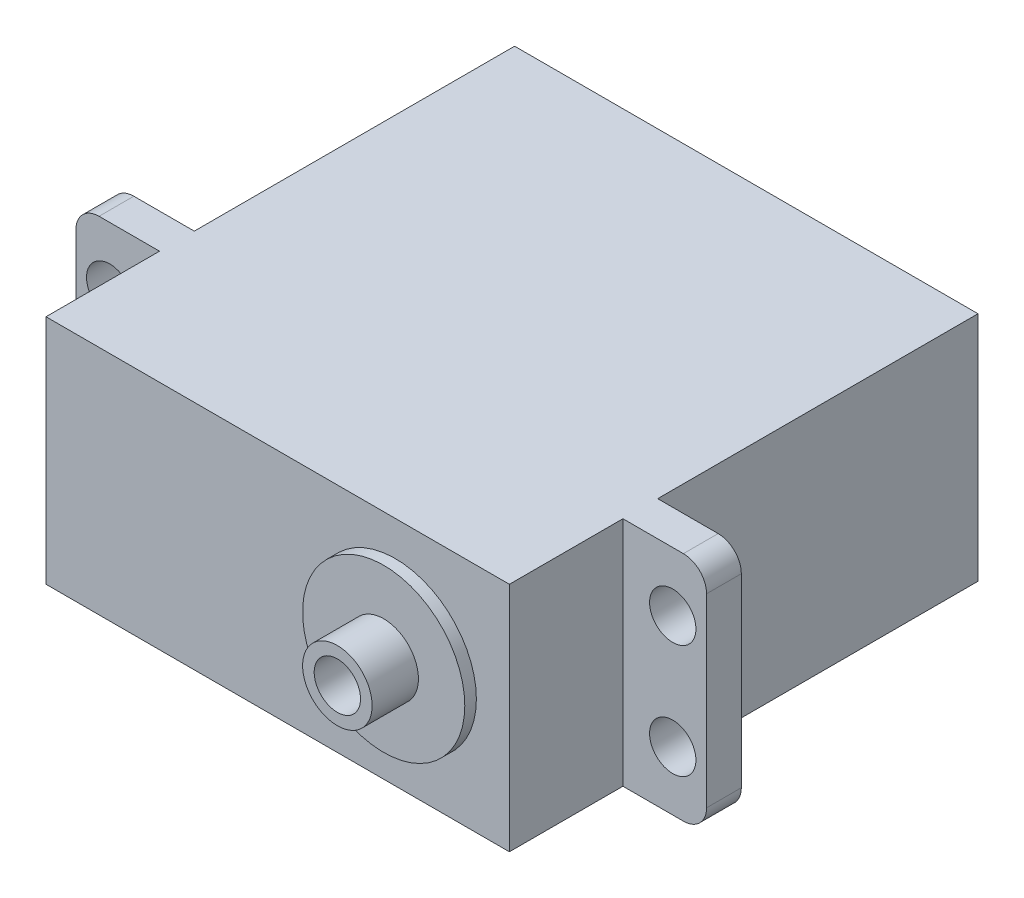
ISO-10303-21;
HEADER;
FILE_DESCRIPTION(('STEP AP214'),'2;1');
FILE_NAME('part.step','',(''),(''),'','','');
FILE_SCHEMA(('AUTOMOTIVE_DESIGN { 1 0 10303 214 1 1 1 1 }'));
ENDSEC;
DATA;
#1=APPLICATION_CONTEXT('core data for automotive mechanical design processes');
#2=APPLICATION_PROTOCOL_DEFINITION('international standard','automotive_design',2000,#1);
#3=PRODUCT_CONTEXT('',#1,'mechanical');
#4=PRODUCT('Part','Part','',(#3));
#5=PRODUCT_RELATED_PRODUCT_CATEGORY('part','',(#4));
#6=PRODUCT_DEFINITION_FORMATION('','',#4);
#7=PRODUCT_DEFINITION_CONTEXT('part definition',#1,'design');
#8=PRODUCT_DEFINITION('design','',#6,#7);
#9=PRODUCT_DEFINITION_SHAPE('','',#8);
#10=(LENGTH_UNIT() NAMED_UNIT(*) SI_UNIT(.MILLI.,.METRE.));
#11=(NAMED_UNIT(*) PLANE_ANGLE_UNIT() SI_UNIT($,.RADIAN.));
#12=(NAMED_UNIT(*) SI_UNIT($,.STERADIAN.) SOLID_ANGLE_UNIT());
#13=UNCERTAINTY_MEASURE_WITH_UNIT(LENGTH_MEASURE(1.E-05),#10,'distance_accuracy_value','');
#14=(GEOMETRIC_REPRESENTATION_CONTEXT(3) GLOBAL_UNCERTAINTY_ASSIGNED_CONTEXT((#13)) GLOBAL_UNIT_ASSIGNED_CONTEXT((#10,
#11,#12)) REPRESENTATION_CONTEXT('',''));
#15=CARTESIAN_POINT('',(0.,0.,0.));
#16=DIRECTION('',(0.,0.,1.));
#17=DIRECTION('',(1.,0.,0.));
#18=AXIS2_PLACEMENT_3D('',#15,#16,#17);
#19=CARTESIAN_POINT('',(0.,0.,30.65));
#20=DIRECTION('',(0.,0.,1.));
#21=DIRECTION('',(1.,0.,0.));
#22=AXIS2_PLACEMENT_3D('',#19,#20,#21);
#23=PLANE('',#22);
#24=DIRECTION('',(0.,1.,0.));
#25=VECTOR('',#24,1.);
#26=CARTESIAN_POINT('',(-6.37221553686137,208.387921433187,30.65));
#27=LINE('',#26,#25);
#28=CARTESIAN_POINT('',(-6.37221553686137,210.387921433187,30.65));
#29=VERTEX_POINT('',#28);
#30=CARTESIAN_POINT('',(-6.37221553686137,226.387921433187,30.65));
#31=VERTEX_POINT('',#30);
#32=EDGE_CURVE('E200',#29,#31,#27,.T.);
#33=ORIENTED_EDGE('',*,*,#32,.T.);
#34=CARTESIAN_POINT('',(-8.37221553686137,226.387921433187,30.65));
#35=DIRECTION('',(0.,0.,1.));
#36=DIRECTION('',(1.,0.,0.));
#37=AXIS2_PLACEMENT_3D('',#34,#35,#36);
#38=CIRCLE('',#37,2.);
#39=CARTESIAN_POINT('',(-8.37221553686137,228.387921433187,30.65));
#40=VERTEX_POINT('',#39);
#41=EDGE_CURVE('E11',#31,#40,#38,.T.);
#42=ORIENTED_EDGE('',*,*,#41,.T.);
#43=DIRECTION('',(-1.,0.,0.));
#44=VECTOR('',#43,1.);
#45=CARTESIAN_POINT('',(-6.37221553686137,228.387921433187,30.65));
#46=LINE('',#45,#44);
#47=CARTESIAN_POINT('',(-13.5922155368614,228.387921433187,30.65));
#48=VERTEX_POINT('',#47);
#49=EDGE_CURVE('E203',#40,#48,#46,.T.);
#50=ORIENTED_EDGE('',*,*,#49,.T.);
#51=DIRECTION('',(0.,1.,0.));
#52=VECTOR('',#51,1.);
#53=CARTESIAN_POINT('',(-13.5922155368614,208.387921433187,30.65));
#54=LINE('',#53,#52);
#55=CARTESIAN_POINT('',(-13.5922155368614,208.387921433187,30.65));
#56=VERTEX_POINT('',#55);
#57=EDGE_CURVE('E163',#56,#48,#54,.T.);
#58=ORIENTED_EDGE('',*,*,#57,.F.);
#59=DIRECTION('',(1.,0.,0.));
#60=VECTOR('',#59,1.);
#61=CARTESIAN_POINT('',(-6.37221553686137,208.387921433187,30.65));
#62=LINE('',#61,#60);
#63=CARTESIAN_POINT('',(-8.37221553686137,208.387921433187,30.65));
#64=VERTEX_POINT('',#63);
#65=EDGE_CURVE('E208',#56,#64,#62,.T.);
#66=ORIENTED_EDGE('',*,*,#65,.T.);
#67=CARTESIAN_POINT('',(-8.37221553686137,210.387921433187,30.65));
#68=DIRECTION('',(0.,0.,1.));
#69=DIRECTION('',(1.,0.,0.));
#70=AXIS2_PLACEMENT_3D('',#67,#68,#69);
#71=CIRCLE('',#70,2.);
#72=EDGE_CURVE('E38',#64,#29,#71,.T.);
#73=ORIENTED_EDGE('',*,*,#72,.T.);
#74=EDGE_LOOP('',(#33,#42,#50,#58,#66,#73));
#75=FACE_BOUND('',#74,.T.);
#76=CARTESIAN_POINT('',(-9.29221553686137,223.287921433187,30.65));
#77=DIRECTION('',(0.,0.,1.));
#78=DIRECTION('',(1.,0.,0.));
#79=AXIS2_PLACEMENT_3D('',#76,#77,#78);
#80=CIRCLE('',#79,2.);
#81=CARTESIAN_POINT('',(-7.29221553686137,223.287921433187,30.65));
#82=VERTEX_POINT('',#81);
#83=EDGE_CURVE('E188',#82,#82,#80,.T.);
#84=ORIENTED_EDGE('',*,*,#83,.F.);
#85=EDGE_LOOP('',(#84));
#86=FACE_BOUND('',#85,.T.);
#87=CARTESIAN_POINT('',(-9.29221553686137,213.487921433187,30.65));
#88=DIRECTION('',(0.,0.,1.));
#89=DIRECTION('',(1.,0.,0.));
#90=AXIS2_PLACEMENT_3D('',#87,#88,#89);
#91=CIRCLE('',#90,2.);
#92=CARTESIAN_POINT('',(-7.29221553686137,213.487921433187,30.65));
#93=VERTEX_POINT('',#92);
#94=EDGE_CURVE('E194',#93,#93,#91,.T.);
#95=ORIENTED_EDGE('',*,*,#94,.F.);
#96=EDGE_LOOP('',(#95));
#97=FACE_BOUND('',#96,.T.);
#98=ADVANCED_FACE('F30',(#75,#86,#97),#23,.T.);
#99=CARTESIAN_POINT('',(-13.5922155368614,208.387921433187,27.65));
#100=DIRECTION('',(-1.,0.,0.));
#101=DIRECTION('',(0.,-1.,0.));
#102=AXIS2_PLACEMENT_3D('',#99,#100,#101);
#103=PLANE('',#102);
#104=DIRECTION('',(0.,1.,0.));
#105=VECTOR('',#104,1.);
#106=CARTESIAN_POINT('',(-13.5922155368614,208.387921433187,0.));
#107=LINE('',#106,#105);
#108=CARTESIAN_POINT('',(-13.5922155368614,208.387921433187,0.));
#109=VERTEX_POINT('',#108);
#110=CARTESIAN_POINT('',(-13.5922155368614,228.387921433187,0.));
#111=VERTEX_POINT('',#110);
#112=EDGE_CURVE('E211',#109,#111,#107,.T.);
#113=ORIENTED_EDGE('',*,*,#112,.T.);
#114=DIRECTION('',(0.,0.,-1.));
#115=VECTOR('',#114,1.);
#116=CARTESIAN_POINT('',(-13.5922155368614,228.387921433187,27.65));
#117=LINE('',#116,#115);
#118=CARTESIAN_POINT('',(-13.5922155368614,228.387921433187,27.65));
#119=VERTEX_POINT('',#118);
#120=EDGE_CURVE('E244',#119,#111,#117,.T.);
#121=ORIENTED_EDGE('',*,*,#120,.F.);
#122=DIRECTION('',(0.,1.,0.));
#123=VECTOR('',#122,1.);
#124=CARTESIAN_POINT('',(-13.5922155368614,208.387921433187,27.65));
#125=LINE('',#124,#123);
#126=CARTESIAN_POINT('',(-13.5922155368614,208.387921433187,27.65));
#127=VERTEX_POINT('',#126);
#128=EDGE_CURVE('E221',#127,#119,#125,.T.);
#129=ORIENTED_EDGE('',*,*,#128,.F.);
#130=DIRECTION('',(0.,0.,-1.));
#131=VECTOR('',#130,1.);
#132=CARTESIAN_POINT('',(-13.5922155368614,208.387921433187,27.65));
#133=LINE('',#132,#131);
#134=EDGE_CURVE('E228',#127,#109,#133,.T.);
#135=ORIENTED_EDGE('',*,*,#134,.T.);
#136=EDGE_LOOP('',(#113,#121,#129,#135));
#137=FACE_BOUND('',#136,.T.);
#138=ADVANCED_FACE('F366',(#137),#103,.F.);
#139=CARTESIAN_POINT('',(-13.5922155368614,228.387921433187,27.65));
#140=DIRECTION('',(0.,-1.,0.));
#141=DIRECTION('',(0.,0.,-1.));
#142=AXIS2_PLACEMENT_3D('',#139,#140,#141);
#143=PLANE('',#142);
#144=DIRECTION('',(-1.,0.,0.));
#145=VECTOR('',#144,1.);
#146=CARTESIAN_POINT('',(-6.37221553686137,228.387921433187,27.65));
#147=LINE('',#146,#145);
#148=CARTESIAN_POINT('',(-53.5922155368614,228.387921433187,27.65));
#149=VERTEX_POINT('',#148);
#150=CARTESIAN_POINT('',(-58.8122155368614,228.387921433187,27.65));
#151=VERTEX_POINT('',#150);
#152=EDGE_CURVE('E213',#149,#151,#147,.T.);
#153=ORIENTED_EDGE('',*,*,#152,.T.);
#154=DIRECTION('',(0.,0.,-1.));
#155=VECTOR('',#154,1.);
#156=CARTESIAN_POINT('',(-58.8122155368614,228.387921433187,27.65));
#157=LINE('',#156,#155);
#158=CARTESIAN_POINT('',(-58.8122155368614,228.387921433187,30.65));
#159=VERTEX_POINT('',#158);
#160=EDGE_CURVE('E260',#151,#159,#157,.F.);
#161=ORIENTED_EDGE('',*,*,#160,.T.);
#162=CARTESIAN_POINT('',(-53.5922155368614,228.387921433187,30.65));
#163=VERTEX_POINT('',#162);
#164=EDGE_CURVE('E169',#163,#159,#46,.T.);
#165=ORIENTED_EDGE('',*,*,#164,.F.);
#166=DIRECTION('',(0.,0.,-1.));
#167=VECTOR('',#166,1.);
#168=CARTESIAN_POINT('',(-53.5922155368614,228.387921433187,40.45));
#169=LINE('',#168,#167);
#170=CARTESIAN_POINT('',(-53.5922155368614,228.387921433187,40.45));
#171=VERTEX_POINT('',#170);
#172=EDGE_CURVE('E148',#171,#163,#169,.T.);
#173=ORIENTED_EDGE('',*,*,#172,.F.);
#174=DIRECTION('',(-1.,0.,0.));
#175=VECTOR('',#174,1.);
#176=CARTESIAN_POINT('',(-13.5922155368614,228.387921433187,40.45));
#177=LINE('',#176,#175);
#178=CARTESIAN_POINT('',(-13.5922155368614,228.387921433187,40.45));
#179=VERTEX_POINT('',#178);
#180=EDGE_CURVE('E154',#179,#171,#177,.T.);
#181=ORIENTED_EDGE('',*,*,#180,.F.);
#182=DIRECTION('',(0.,0.,-1.));
#183=VECTOR('',#182,1.);
#184=CARTESIAN_POINT('',(-13.5922155368614,228.387921433187,40.45));
#185=LINE('',#184,#183);
#186=EDGE_CURVE('E293',#179,#48,#185,.T.);
#187=ORIENTED_EDGE('',*,*,#186,.T.);
#188=ORIENTED_EDGE('',*,*,#49,.F.);
#189=DIRECTION('',(0.,0.,-1.));
#190=VECTOR('',#189,1.);
#191=CARTESIAN_POINT('',(-8.37221553686137,228.387921433187,27.65));
#192=LINE('',#191,#190);
#193=CARTESIAN_POINT('',(-8.37221553686137,228.387921433187,27.65));
#194=VERTEX_POINT('',#193);
#195=EDGE_CURVE('E257',#40,#194,#192,.T.);
#196=ORIENTED_EDGE('',*,*,#195,.T.);
#197=EDGE_CURVE('E214',#194,#119,#147,.T.);
#198=ORIENTED_EDGE('',*,*,#197,.T.);
#199=ORIENTED_EDGE('',*,*,#120,.T.);
#200=DIRECTION('',(-1.,0.,0.));
#201=VECTOR('',#200,1.);
#202=CARTESIAN_POINT('',(-13.5922155368614,228.387921433187,0.));
#203=LINE('',#202,#201);
#204=CARTESIAN_POINT('',(-53.5922155368614,228.387921433187,0.));
#205=VERTEX_POINT('',#204);
#206=EDGE_CURVE('E231',#111,#205,#203,.T.);
#207=ORIENTED_EDGE('',*,*,#206,.T.);
#208=DIRECTION('',(0.,0.,-1.));
#209=VECTOR('',#208,1.);
#210=CARTESIAN_POINT('',(-53.5922155368614,228.387921433187,27.65));
#211=LINE('',#210,#209);
#212=EDGE_CURVE('E241',#149,#205,#211,.T.);
#213=ORIENTED_EDGE('',*,*,#212,.F.);
#214=EDGE_LOOP('',(#153,#161,#165,#173,#181,#187,#188,#196,#198,#199,#207,#213));
#215=FACE_BOUND('',#214,.T.);
#216=ADVANCED_FACE('F167',(#215),#143,.F.);
#217=CARTESIAN_POINT('',(-53.5922155368614,208.387921433187,27.65));
#218=DIRECTION('',(1.,0.,0.));
#219=DIRECTION('',(0.,0.,-1.));
#220=AXIS2_PLACEMENT_3D('',#217,#218,#219);
#221=PLANE('',#220);
#222=DIRECTION('',(0.,-1.,0.));
#223=VECTOR('',#222,1.);
#224=CARTESIAN_POINT('',(-53.5922155368614,208.387921433187,0.));
#225=LINE('',#224,#223);
#226=CARTESIAN_POINT('',(-53.5922155368614,208.387921433187,0.));
#227=VERTEX_POINT('',#226);
#228=EDGE_CURVE('E233',#205,#227,#225,.T.);
#229=ORIENTED_EDGE('',*,*,#228,.T.);
#230=DIRECTION('',(0.,0.,-1.));
#231=VECTOR('',#230,1.);
#232=CARTESIAN_POINT('',(-53.5922155368614,208.387921433187,27.65));
#233=LINE('',#232,#231);
#234=CARTESIAN_POINT('',(-53.5922155368614,208.387921433187,27.65));
#235=VERTEX_POINT('',#234);
#236=EDGE_CURVE('E238',#235,#227,#233,.T.);
#237=ORIENTED_EDGE('',*,*,#236,.F.);
#238=DIRECTION('',(0.,-1.,0.));
#239=VECTOR('',#238,1.);
#240=CARTESIAN_POINT('',(-53.5922155368614,208.387921433187,27.65));
#241=LINE('',#240,#239);
#242=EDGE_CURVE('E224',#149,#235,#241,.T.);
#243=ORIENTED_EDGE('',*,*,#242,.F.);
#244=ORIENTED_EDGE('',*,*,#212,.T.);
#245=EDGE_LOOP('',(#229,#237,#243,#244));
#246=FACE_BOUND('',#245,.T.);
#247=ADVANCED_FACE('F430',(#246),#221,.F.);
#248=CARTESIAN_POINT('',(-13.5922155368614,208.387921433187,27.65));
#249=DIRECTION('',(0.,1.,0.));
#250=DIRECTION('',(0.,0.,1.));
#251=AXIS2_PLACEMENT_3D('',#248,#249,#250);
#252=PLANE('',#251);
#253=CARTESIAN_POINT('',(-58.8122155368614,208.387921433187,30.65));
#254=VERTEX_POINT('',#253);
#255=CARTESIAN_POINT('',(-53.5922155368614,208.387921433187,30.65));
#256=VERTEX_POINT('',#255);
#257=EDGE_CURVE('E209',#254,#256,#62,.T.);
#258=ORIENTED_EDGE('',*,*,#257,.F.);
#259=DIRECTION('',(0.,0.,-1.));
#260=VECTOR('',#259,1.);
#261=CARTESIAN_POINT('',(-58.8122155368614,208.387921433187,27.65));
#262=LINE('',#261,#260);
#263=CARTESIAN_POINT('',(-58.8122155368614,208.387921433187,27.65));
#264=VERTEX_POINT('',#263);
#265=EDGE_CURVE('E268',#254,#264,#262,.T.);
#266=ORIENTED_EDGE('',*,*,#265,.T.);
#267=DIRECTION('',(1.,0.,0.));
#268=VECTOR('',#267,1.);
#269=CARTESIAN_POINT('',(-6.37221553686137,208.387921433187,27.65));
#270=LINE('',#269,#268);
#271=EDGE_CURVE('E202',#264,#235,#270,.T.);
#272=ORIENTED_EDGE('',*,*,#271,.T.);
#273=ORIENTED_EDGE('',*,*,#236,.T.);
#274=DIRECTION('',(1.,0.,0.));
#275=VECTOR('',#274,1.);
#276=CARTESIAN_POINT('',(-13.5922155368614,208.387921433187,0.));
#277=LINE('',#276,#275);
#278=EDGE_CURVE('E225',#227,#109,#277,.T.);
#279=ORIENTED_EDGE('',*,*,#278,.T.);
#280=ORIENTED_EDGE('',*,*,#134,.F.);
#281=CARTESIAN_POINT('',(-8.37221553686137,208.387921433187,27.65));
#282=VERTEX_POINT('',#281);
#283=EDGE_CURVE('E219',#127,#282,#270,.T.);
#284=ORIENTED_EDGE('',*,*,#283,.T.);
#285=DIRECTION('',(0.,0.,-1.));
#286=VECTOR('',#285,1.);
#287=CARTESIAN_POINT('',(-8.37221553686137,208.387921433187,27.65));
#288=LINE('',#287,#286);
#289=EDGE_CURVE('E266',#282,#64,#288,.F.);
#290=ORIENTED_EDGE('',*,*,#289,.T.);
#291=ORIENTED_EDGE('',*,*,#65,.F.);
#292=DIRECTION('',(0.,0.,-1.));
#293=VECTOR('',#292,1.);
#294=CARTESIAN_POINT('',(-13.5922155368614,208.387921433187,40.45));
#295=LINE('',#294,#293);
#296=CARTESIAN_POINT('',(-13.5922155368614,208.387921433187,40.45));
#297=VERTEX_POINT('',#296);
#298=EDGE_CURVE('E175',#297,#56,#295,.T.);
#299=ORIENTED_EDGE('',*,*,#298,.F.);
#300=DIRECTION('',(1.,0.,0.));
#301=VECTOR('',#300,1.);
#302=CARTESIAN_POINT('',(-53.5922155368614,208.387921433187,40.45));
#303=LINE('',#302,#301);
#304=CARTESIAN_POINT('',(-53.5922155368614,208.387921433187,40.45));
#305=VERTEX_POINT('',#304);
#306=EDGE_CURVE('E153',#305,#297,#303,.T.);
#307=ORIENTED_EDGE('',*,*,#306,.F.);
#308=DIRECTION('',(0.,0.,-1.));
#309=VECTOR('',#308,1.);
#310=CARTESIAN_POINT('',(-53.5922155368614,208.387921433187,40.45));
#311=LINE('',#310,#309);
#312=EDGE_CURVE('E150',#305,#256,#311,.T.);
#313=ORIENTED_EDGE('',*,*,#312,.T.);
#314=EDGE_LOOP('',(#258,#266,#272,#273,#279,#280,#284,#290,#291,#299,#307,#313));
#315=FACE_BOUND('',#314,.T.);
#316=ADVANCED_FACE('F414',(#315),#252,.F.);
#317=CARTESIAN_POINT('',(0.,0.,0.));
#318=DIRECTION('',(0.,0.,1.));
#319=DIRECTION('',(1.,0.,0.));
#320=AXIS2_PLACEMENT_3D('',#317,#318,#319);
#321=PLANE('',#320);
#322=ORIENTED_EDGE('',*,*,#112,.F.);
#323=ORIENTED_EDGE('',*,*,#278,.F.);
#324=ORIENTED_EDGE('',*,*,#228,.F.);
#325=ORIENTED_EDGE('',*,*,#206,.F.);
#326=EDGE_LOOP('',(#322,#323,#324,#325));
#327=FACE_BOUND('',#326,.T.);
#328=ADVANCED_FACE('F436',(#327),#321,.F.);
#329=CARTESIAN_POINT('',(0.,0.,27.65));
#330=DIRECTION('',(0.,0.,1.));
#331=DIRECTION('',(1.,0.,0.));
#332=AXIS2_PLACEMENT_3D('',#329,#330,#331);
#333=PLANE('',#332);
#334=CARTESIAN_POINT('',(-9.29221553686137,213.487921433187,27.65));
#335=DIRECTION('',(0.,0.,1.));
#336=DIRECTION('',(1.,0.,0.));
#337=AXIS2_PLACEMENT_3D('',#334,#335,#336);
#338=CIRCLE('',#337,2.);
#339=CARTESIAN_POINT('',(-7.29221553686137,213.487921433187,27.65));
#340=VERTEX_POINT('',#339);
#341=EDGE_CURVE('E191',#340,#340,#338,.T.);
#342=ORIENTED_EDGE('',*,*,#341,.T.);
#343=EDGE_LOOP('',(#342));
#344=FACE_BOUND('',#343,.T.);
#345=CARTESIAN_POINT('',(-9.29221553686137,223.287921433187,27.65));
#346=DIRECTION('',(0.,0.,1.));
#347=DIRECTION('',(1.,0.,0.));
#348=AXIS2_PLACEMENT_3D('',#345,#346,#347);
#349=CIRCLE('',#348,2.);
#350=CARTESIAN_POINT('',(-7.29221553686137,223.287921433187,27.65));
#351=VERTEX_POINT('',#350);
#352=EDGE_CURVE('E185',#351,#351,#349,.T.);
#353=ORIENTED_EDGE('',*,*,#352,.T.);
#354=EDGE_LOOP('',(#353));
#355=FACE_BOUND('',#354,.T.);
#356=ORIENTED_EDGE('',*,*,#197,.F.);
#357=CARTESIAN_POINT('',(-8.37221553686137,226.387921433187,27.65));
#358=DIRECTION('',(0.,0.,1.));
#359=DIRECTION('',(1.,0.,0.));
#360=AXIS2_PLACEMENT_3D('',#357,#358,#359);
#361=CIRCLE('',#360,2.);
#362=CARTESIAN_POINT('',(-6.37221553686137,226.387921433187,27.65));
#363=VERTEX_POINT('',#362);
#364=EDGE_CURVE('E273',#194,#363,#361,.F.);
#365=ORIENTED_EDGE('',*,*,#364,.T.);
#366=DIRECTION('',(0.,1.,0.));
#367=VECTOR('',#366,1.);
#368=CARTESIAN_POINT('',(-6.37221553686137,208.387921433187,27.65));
#369=LINE('',#368,#367);
#370=CARTESIAN_POINT('',(-6.37221553686137,210.387921433187,27.65));
#371=VERTEX_POINT('',#370);
#372=EDGE_CURVE('E197',#371,#363,#369,.T.);
#373=ORIENTED_EDGE('',*,*,#372,.F.);
#374=CARTESIAN_POINT('',(-8.37221553686137,210.387921433187,27.65));
#375=DIRECTION('',(0.,0.,1.));
#376=DIRECTION('',(1.,0.,0.));
#377=AXIS2_PLACEMENT_3D('',#374,#375,#376);
#378=CIRCLE('',#377,2.);
#379=EDGE_CURVE('E271',#371,#282,#378,.F.);
#380=ORIENTED_EDGE('',*,*,#379,.T.);
#381=ORIENTED_EDGE('',*,*,#283,.F.);
#382=ORIENTED_EDGE('',*,*,#128,.T.);
#383=EDGE_LOOP('',(#356,#365,#373,#380,#381,#382));
#384=FACE_BOUND('',#383,.T.);
#385=ADVANCED_FACE('F284',(#344,#355,#384),#333,.F.);
#386=CARTESIAN_POINT('',(-57.8922155368614,213.487921433187,27.65));
#387=DIRECTION('',(0.,0.,1.));
#388=DIRECTION('',(-1.,0.,0.));
#389=AXIS2_PLACEMENT_3D('',#386,#387,#388);
#390=CIRCLE('',#389,2.);
#391=CARTESIAN_POINT('',(-59.8922155368614,213.487921433187,27.65));
#392=VERTEX_POINT('',#391);
#393=EDGE_CURVE('E170',#392,#392,#390,.T.);
#394=ORIENTED_EDGE('',*,*,#393,.T.);
#395=EDGE_LOOP('',(#394));
#396=FACE_BOUND('',#395,.T.);
#397=CARTESIAN_POINT('',(-57.8922155368614,223.287921433187,27.65));
#398=DIRECTION('',(0.,0.,1.));
#399=DIRECTION('',(-1.,0.,0.));
#400=AXIS2_PLACEMENT_3D('',#397,#398,#399);
#401=CIRCLE('',#400,2.);
#402=CARTESIAN_POINT('',(-59.8922155368614,223.287921433187,27.65));
#403=VERTEX_POINT('',#402);
#404=EDGE_CURVE('E180',#403,#403,#401,.T.);
#405=ORIENTED_EDGE('',*,*,#404,.T.);
#406=EDGE_LOOP('',(#405));
#407=FACE_BOUND('',#406,.T.);
#408=DIRECTION('',(0.,-1.,0.));
#409=VECTOR('',#408,1.);
#410=CARTESIAN_POINT('',(-60.8122155368614,208.387921433187,27.65));
#411=LINE('',#410,#409);
#412=CARTESIAN_POINT('',(-60.8122155368614,226.387921433187,27.65));
#413=VERTEX_POINT('',#412);
#414=CARTESIAN_POINT('',(-60.8122155368614,210.387921433187,27.65));
#415=VERTEX_POINT('',#414);
#416=EDGE_CURVE('E216',#413,#415,#411,.T.);
#417=ORIENTED_EDGE('',*,*,#416,.F.);
#418=CARTESIAN_POINT('',(-58.8122155368614,226.387921433187,27.65));
#419=DIRECTION('',(0.,0.,1.));
#420=DIRECTION('',(1.,0.,0.));
#421=AXIS2_PLACEMENT_3D('',#418,#419,#420);
#422=CIRCLE('',#421,2.);
#423=EDGE_CURVE('E255',#413,#151,#422,.F.);
#424=ORIENTED_EDGE('',*,*,#423,.T.);
#425=ORIENTED_EDGE('',*,*,#152,.F.);
#426=ORIENTED_EDGE('',*,*,#242,.T.);
#427=ORIENTED_EDGE('',*,*,#271,.F.);
#428=CARTESIAN_POINT('',(-58.8122155368614,210.387921433187,27.65));
#429=DIRECTION('',(0.,0.,1.));
#430=DIRECTION('',(1.,0.,0.));
#431=AXIS2_PLACEMENT_3D('',#428,#429,#430);
#432=CIRCLE('',#431,2.);
#433=EDGE_CURVE('E253',#264,#415,#432,.F.);
#434=ORIENTED_EDGE('',*,*,#433,.T.);
#435=EDGE_LOOP('',(#417,#424,#425,#426,#427,#434));
#436=FACE_BOUND('',#435,.T.);
#437=ADVANCED_FACE('F377',(#396,#407,#436),#333,.F.);
#438=ORIENTED_EDGE('',*,*,#164,.T.);
#439=CARTESIAN_POINT('',(-58.8122155368614,226.387921433187,30.65));
#440=DIRECTION('',(0.,0.,1.));
#441=DIRECTION('',(1.,0.,0.));
#442=AXIS2_PLACEMENT_3D('',#439,#440,#441);
#443=CIRCLE('',#442,2.);
#444=CARTESIAN_POINT('',(-60.8122155368614,226.387921433187,30.65));
#445=VERTEX_POINT('',#444);
#446=EDGE_CURVE('E264',#159,#445,#443,.T.);
#447=ORIENTED_EDGE('',*,*,#446,.T.);
#448=DIRECTION('',(0.,-1.,0.));
#449=VECTOR('',#448,1.);
#450=CARTESIAN_POINT('',(-60.8122155368614,208.387921433187,30.65));
#451=LINE('',#450,#449);
#452=CARTESIAN_POINT('',(-60.8122155368614,210.387921433187,30.65));
#453=VERTEX_POINT('',#452);
#454=EDGE_CURVE('E205',#445,#453,#451,.T.);
#455=ORIENTED_EDGE('',*,*,#454,.T.);
#456=CARTESIAN_POINT('',(-58.8122155368614,210.387921433187,30.65));
#457=DIRECTION('',(0.,0.,1.));
#458=DIRECTION('',(1.,0.,0.));
#459=AXIS2_PLACEMENT_3D('',#456,#457,#458);
#460=CIRCLE('',#459,2.);
#461=EDGE_CURVE('E262',#453,#254,#460,.T.);
#462=ORIENTED_EDGE('',*,*,#461,.T.);
#463=ORIENTED_EDGE('',*,*,#257,.T.);
#464=DIRECTION('',(0.,-1.,0.));
#465=VECTOR('',#464,1.);
#466=CARTESIAN_POINT('',(-53.5922155368614,228.387921433187,30.65));
#467=LINE('',#466,#465);
#468=EDGE_CURVE('E301',#163,#256,#467,.T.);
#469=ORIENTED_EDGE('',*,*,#468,.F.);
#470=EDGE_LOOP('',(#438,#447,#455,#462,#463,#469));
#471=FACE_BOUND('',#470,.T.);
#472=CARTESIAN_POINT('',(-57.8922155368614,223.287921433187,30.65));
#473=DIRECTION('',(0.,0.,1.));
#474=DIRECTION('',(-1.,0.,0.));
#475=AXIS2_PLACEMENT_3D('',#472,#473,#474);
#476=CIRCLE('',#475,2.);
#477=CARTESIAN_POINT('',(-59.8922155368614,223.287921433187,30.65));
#478=VERTEX_POINT('',#477);
#479=EDGE_CURVE('E182',#478,#478,#476,.T.);
#480=ORIENTED_EDGE('',*,*,#479,.F.);
#481=EDGE_LOOP('',(#480));
#482=FACE_BOUND('',#481,.T.);
#483=CARTESIAN_POINT('',(-57.8922155368614,213.487921433187,30.65));
#484=DIRECTION('',(0.,0.,1.));
#485=DIRECTION('',(-1.,0.,0.));
#486=AXIS2_PLACEMENT_3D('',#483,#484,#485);
#487=CIRCLE('',#486,2.);
#488=CARTESIAN_POINT('',(-59.8922155368614,213.487921433187,30.65));
#489=VERTEX_POINT('',#488);
#490=EDGE_CURVE('E173',#489,#489,#487,.T.);
#491=ORIENTED_EDGE('',*,*,#490,.F.);
#492=EDGE_LOOP('',(#491));
#493=FACE_BOUND('',#492,.T.);
#494=ADVANCED_FACE('F368',(#471,#482,#493),#23,.T.);
#495=CARTESIAN_POINT('',(-6.37221553686137,208.387921433187,30.65));
#496=DIRECTION('',(-1.,0.,0.));
#497=DIRECTION('',(0.,0.,1.));
#498=AXIS2_PLACEMENT_3D('',#495,#496,#497);
#499=PLANE('',#498);
#500=ORIENTED_EDGE('',*,*,#372,.T.);
#501=DIRECTION('',(0.,0.,-1.));
#502=VECTOR('',#501,1.);
#503=CARTESIAN_POINT('',(-6.37221553686137,226.387921433187,30.65));
#504=LINE('',#503,#502);
#505=EDGE_CURVE('E45',#363,#31,#504,.F.);
#506=ORIENTED_EDGE('',*,*,#505,.T.);
#507=ORIENTED_EDGE('',*,*,#32,.F.);
#508=DIRECTION('',(0.,0.,-1.));
#509=VECTOR('',#508,1.);
#510=CARTESIAN_POINT('',(-6.37221553686137,210.387921433187,30.65));
#511=LINE('',#510,#509);
#512=EDGE_CURVE('E275',#29,#371,#511,.T.);
#513=ORIENTED_EDGE('',*,*,#512,.T.);
#514=EDGE_LOOP('',(#500,#506,#507,#513));
#515=FACE_BOUND('',#514,.T.);
#516=ADVANCED_FACE('F280',(#515),#499,.F.);
#517=CARTESIAN_POINT('',(-60.8122155368614,208.387921433187,30.65));
#518=DIRECTION('',(1.,0.,0.));
#519=DIRECTION('',(0.,0.,-1.));
#520=AXIS2_PLACEMENT_3D('',#517,#518,#519);
#521=PLANE('',#520);
#522=ORIENTED_EDGE('',*,*,#454,.F.);
#523=DIRECTION('',(0.,0.,-1.));
#524=VECTOR('',#523,1.);
#525=CARTESIAN_POINT('',(-60.8122155368614,226.387921433187,30.65));
#526=LINE('',#525,#524);
#527=EDGE_CURVE('E250',#445,#413,#526,.T.);
#528=ORIENTED_EDGE('',*,*,#527,.T.);
#529=ORIENTED_EDGE('',*,*,#416,.T.);
#530=DIRECTION('',(0.,0.,-1.));
#531=VECTOR('',#530,1.);
#532=CARTESIAN_POINT('',(-60.8122155368614,210.387921433187,30.65));
#533=LINE('',#532,#531);
#534=EDGE_CURVE('E248',#415,#453,#533,.F.);
#535=ORIENTED_EDGE('',*,*,#534,.T.);
#536=EDGE_LOOP('',(#522,#528,#529,#535));
#537=FACE_BOUND('',#536,.T.);
#538=ADVANCED_FACE('F383',(#537),#521,.F.);
#539=CARTESIAN_POINT('',(-9.29221553686137,213.487921433187,30.65));
#540=DIRECTION('',(0.,0.,-1.));
#541=DIRECTION('',(-1.,0.,0.));
#542=AXIS2_PLACEMENT_3D('',#539,#540,#541);
#543=CYLINDRICAL_SURFACE('',#542,2.);
#544=ORIENTED_EDGE('',*,*,#94,.T.);
#545=EDGE_LOOP('',(#544));
#546=FACE_BOUND('',#545,.T.);
#547=ORIENTED_EDGE('',*,*,#341,.F.);
#548=EDGE_LOOP('',(#547));
#549=FACE_BOUND('',#548,.T.);
#550=ADVANCED_FACE('F441',(#546,#549),#543,.F.);
#551=CARTESIAN_POINT('',(-9.29221553686137,223.287921433187,30.65));
#552=DIRECTION('',(0.,0.,-1.));
#553=DIRECTION('',(-1.,0.,0.));
#554=AXIS2_PLACEMENT_3D('',#551,#552,#553);
#555=CYLINDRICAL_SURFACE('',#554,2.);
#556=ORIENTED_EDGE('',*,*,#83,.T.);
#557=EDGE_LOOP('',(#556));
#558=FACE_BOUND('',#557,.T.);
#559=ORIENTED_EDGE('',*,*,#352,.F.);
#560=EDGE_LOOP('',(#559));
#561=FACE_BOUND('',#560,.T.);
#562=ADVANCED_FACE('F450',(#558,#561),#555,.F.);
#563=CARTESIAN_POINT('',(-57.8922155368614,223.287921433187,30.65));
#564=DIRECTION('',(0.,0.,-1.));
#565=DIRECTION('',(-1.,0.,0.));
#566=AXIS2_PLACEMENT_3D('',#563,#564,#565);
#567=CYLINDRICAL_SURFACE('',#566,2.);
#568=ORIENTED_EDGE('',*,*,#479,.T.);
#569=EDGE_LOOP('',(#568));
#570=FACE_BOUND('',#569,.T.);
#571=ORIENTED_EDGE('',*,*,#404,.F.);
#572=EDGE_LOOP('',(#571));
#573=FACE_BOUND('',#572,.T.);
#574=ADVANCED_FACE('F395',(#570,#573),#567,.F.);
#575=CARTESIAN_POINT('',(-57.8922155368614,213.487921433187,30.65));
#576=DIRECTION('',(0.,0.,-1.));
#577=DIRECTION('',(-1.,0.,0.));
#578=AXIS2_PLACEMENT_3D('',#575,#576,#577);
#579=CYLINDRICAL_SURFACE('',#578,2.);
#580=ORIENTED_EDGE('',*,*,#490,.T.);
#581=EDGE_LOOP('',(#580));
#582=FACE_BOUND('',#581,.T.);
#583=ORIENTED_EDGE('',*,*,#393,.F.);
#584=EDGE_LOOP('',(#583));
#585=FACE_BOUND('',#584,.T.);
#586=ADVANCED_FACE('F392',(#582,#585),#579,.F.);
#587=CARTESIAN_POINT('',(-53.5922155368614,228.387921433187,40.45));
#588=DIRECTION('',(1.,0.,0.));
#589=DIRECTION('',(0.,0.,-1.));
#590=AXIS2_PLACEMENT_3D('',#587,#588,#589);
#591=PLANE('',#590);
#592=ORIENTED_EDGE('',*,*,#468,.T.);
#593=ORIENTED_EDGE('',*,*,#312,.F.);
#594=DIRECTION('',(0.,-1.,0.));
#595=VECTOR('',#594,1.);
#596=CARTESIAN_POINT('',(-53.5922155368614,228.387921433187,40.45));
#597=LINE('',#596,#595);
#598=EDGE_CURVE('E143',#171,#305,#597,.T.);
#599=ORIENTED_EDGE('',*,*,#598,.F.);
#600=ORIENTED_EDGE('',*,*,#172,.T.);
#601=EDGE_LOOP('',(#592,#593,#599,#600));
#602=FACE_BOUND('',#601,.T.);
#603=ADVANCED_FACE('F146',(#602),#591,.F.);
#604=CARTESIAN_POINT('',(-13.5922155368614,208.387921433187,40.45));
#605=DIRECTION('',(-1.,0.,0.));
#606=DIRECTION('',(0.,-1.,0.));
#607=AXIS2_PLACEMENT_3D('',#604,#605,#606);
#608=PLANE('',#607);
#609=ORIENTED_EDGE('',*,*,#57,.T.);
#610=ORIENTED_EDGE('',*,*,#186,.F.);
#611=DIRECTION('',(0.,1.,0.));
#612=VECTOR('',#611,1.);
#613=CARTESIAN_POINT('',(-13.5922155368614,208.387921433187,40.45));
#614=LINE('',#613,#612);
#615=EDGE_CURVE('E159',#297,#179,#614,.T.);
#616=ORIENTED_EDGE('',*,*,#615,.F.);
#617=ORIENTED_EDGE('',*,*,#298,.T.);
#618=EDGE_LOOP('',(#609,#610,#616,#617));
#619=FACE_BOUND('',#618,.T.);
#620=ADVANCED_FACE('F299',(#619),#608,.F.);
#621=CARTESIAN_POINT('',(0.,0.,40.45));
#622=DIRECTION('',(0.,0.,1.));
#623=DIRECTION('',(1.,0.,0.));
#624=AXIS2_PLACEMENT_3D('',#621,#622,#623);
#625=PLANE('',#624);
#626=CARTESIAN_POINT('',(-23.4422155368614,218.387921433187,40.45));
#627=DIRECTION('',(0.,0.,1.));
#628=DIRECTION('',(1.,0.,0.));
#629=AXIS2_PLACEMENT_3D('',#626,#627,#628);
#630=CIRCLE('',#629,7.);
#631=CARTESIAN_POINT('',(-16.4422155368614,218.387921433187,40.45));
#632=VERTEX_POINT('',#631);
#633=EDGE_CURVE('E309',#632,#632,#630,.T.);
#634=ORIENTED_EDGE('',*,*,#633,.F.);
#635=EDGE_LOOP('',(#634));
#636=FACE_BOUND('',#635,.T.);
#637=ORIENTED_EDGE('',*,*,#180,.T.);
#638=ORIENTED_EDGE('',*,*,#598,.T.);
#639=ORIENTED_EDGE('',*,*,#306,.T.);
#640=ORIENTED_EDGE('',*,*,#615,.T.);
#641=EDGE_LOOP('',(#637,#638,#639,#640));
#642=FACE_BOUND('',#641,.T.);
#643=ADVANCED_FACE('F157',(#636,#642),#625,.T.);
#644=CARTESIAN_POINT('',(-23.4422155368614,218.387921433187,41.45));
#645=DIRECTION('',(0.,0.,-1.));
#646=DIRECTION('',(-1.,0.,0.));
#647=AXIS2_PLACEMENT_3D('',#644,#645,#646);
#648=CYLINDRICAL_SURFACE('',#647,7.);
#649=CARTESIAN_POINT('',(-23.4422155368614,218.387921433187,41.45));
#650=DIRECTION('',(0.,0.,1.));
#651=DIRECTION('',(1.,0.,0.));
#652=AXIS2_PLACEMENT_3D('',#649,#650,#651);
#653=CIRCLE('',#652,7.);
#654=CARTESIAN_POINT('',(-16.4422155368614,218.387921433187,41.45));
#655=VERTEX_POINT('',#654);
#656=EDGE_CURVE('E303',#655,#655,#653,.T.);
#657=ORIENTED_EDGE('',*,*,#656,.F.);
#658=EDGE_LOOP('',(#657));
#659=FACE_BOUND('',#658,.T.);
#660=ORIENTED_EDGE('',*,*,#633,.T.);
#661=EDGE_LOOP('',(#660));
#662=FACE_BOUND('',#661,.T.);
#663=ADVANCED_FACE('F350',(#659,#662),#648,.T.);
#664=CARTESIAN_POINT('',(-23.4422155368614,218.387921433187,41.45));
#665=DIRECTION('',(0.,0.,1.));
#666=DIRECTION('',(1.,0.,0.));
#667=AXIS2_PLACEMENT_3D('',#664,#665,#666);
#668=PLANE('',#667);
#669=CARTESIAN_POINT('',(-23.4422155368614,218.387921433187,41.45));
#670=DIRECTION('',(0.,0.,1.));
#671=DIRECTION('',(1.,0.,0.));
#672=AXIS2_PLACEMENT_3D('',#669,#670,#671);
#673=CIRCLE('',#672,3.);
#674=CARTESIAN_POINT('',(-20.4422155368614,218.387921433187,41.45));
#675=VERTEX_POINT('',#674);
#676=EDGE_CURVE('E247',#675,#675,#673,.T.);
#677=ORIENTED_EDGE('',*,*,#676,.F.);
#678=EDGE_LOOP('',(#677));
#679=FACE_BOUND('',#678,.T.);
#680=ORIENTED_EDGE('',*,*,#656,.T.);
#681=EDGE_LOOP('',(#680));
#682=FACE_BOUND('',#681,.T.);
#683=ADVANCED_FACE('F344',(#679,#682),#668,.T.);
#684=CARTESIAN_POINT('',(-23.4422155368614,218.387921433187,45.45));
#685=DIRECTION('',(0.,0.,-1.));
#686=DIRECTION('',(-1.,0.,0.));
#687=AXIS2_PLACEMENT_3D('',#684,#685,#686);
#688=CYLINDRICAL_SURFACE('',#687,3.);
#689=CARTESIAN_POINT('',(-23.4422155368614,218.387921433187,45.45));
#690=DIRECTION('',(0.,0.,1.));
#691=DIRECTION('',(1.,0.,0.));
#692=AXIS2_PLACEMENT_3D('',#689,#690,#691);
#693=CIRCLE('',#692,3.);
#694=CARTESIAN_POINT('',(-20.4422155368614,218.387921433187,45.45));
#695=VERTEX_POINT('',#694);
#696=EDGE_CURVE('E312',#695,#695,#693,.T.);
#697=ORIENTED_EDGE('',*,*,#696,.F.);
#698=EDGE_LOOP('',(#697));
#699=FACE_BOUND('',#698,.T.);
#700=ORIENTED_EDGE('',*,*,#676,.T.);
#701=EDGE_LOOP('',(#700));
#702=FACE_BOUND('',#701,.T.);
#703=ADVANCED_FACE('F338',(#699,#702),#688,.T.);
#704=CARTESIAN_POINT('',(-23.4422155368614,218.387921433187,45.45));
#705=DIRECTION('',(0.,0.,1.));
#706=DIRECTION('',(1.,0.,0.));
#707=AXIS2_PLACEMENT_3D('',#704,#705,#706);
#708=PLANE('',#707);
#709=CARTESIAN_POINT('',(-23.4422155368614,218.387921433187,45.45));
#710=DIRECTION('',(0.,0.,1.));
#711=DIRECTION('',(1.,0.,0.));
#712=AXIS2_PLACEMENT_3D('',#709,#710,#711);
#713=CIRCLE('',#712,2.);
#714=CARTESIAN_POINT('',(-21.4422155368614,218.387921433187,45.45));
#715=VERTEX_POINT('',#714);
#716=EDGE_CURVE('E320',#715,#715,#713,.T.);
#717=ORIENTED_EDGE('',*,*,#716,.F.);
#718=EDGE_LOOP('',(#717));
#719=FACE_BOUND('',#718,.T.);
#720=ORIENTED_EDGE('',*,*,#696,.T.);
#721=EDGE_LOOP('',(#720));
#722=FACE_BOUND('',#721,.T.);
#723=ADVANCED_FACE('F334',(#719,#722),#708,.T.);
#724=CARTESIAN_POINT('',(-58.8122155368614,226.387921433187,30.65));
#725=DIRECTION('',(0.,0.,-1.));
#726=DIRECTION('',(-1.,0.,0.));
#727=AXIS2_PLACEMENT_3D('',#724,#725,#726);
#728=CYLINDRICAL_SURFACE('',#727,2.);
#729=ORIENTED_EDGE('',*,*,#446,.F.);
#730=ORIENTED_EDGE('',*,*,#160,.F.);
#731=ORIENTED_EDGE('',*,*,#423,.F.);
#732=ORIENTED_EDGE('',*,*,#527,.F.);
#733=EDGE_LOOP('',(#729,#730,#731,#732));
#734=FACE_BOUND('',#733,.T.);
#735=ADVANCED_FACE('F337',(#734),#728,.T.);
#736=CARTESIAN_POINT('',(-58.8122155368614,210.387921433187,27.65));
#737=DIRECTION('',(0.,0.,-1.));
#738=DIRECTION('',(-1.,0.,0.));
#739=AXIS2_PLACEMENT_3D('',#736,#737,#738);
#740=CYLINDRICAL_SURFACE('',#739,2.);
#741=ORIENTED_EDGE('',*,*,#461,.F.);
#742=ORIENTED_EDGE('',*,*,#534,.F.);
#743=ORIENTED_EDGE('',*,*,#433,.F.);
#744=ORIENTED_EDGE('',*,*,#265,.F.);
#745=EDGE_LOOP('',(#741,#742,#743,#744));
#746=FACE_BOUND('',#745,.T.);
#747=ADVANCED_FACE('F410',(#746),#740,.T.);
#748=CARTESIAN_POINT('',(-8.37221553686137,226.387921433187,27.65));
#749=DIRECTION('',(0.,0.,-1.));
#750=DIRECTION('',(-1.,0.,0.));
#751=AXIS2_PLACEMENT_3D('',#748,#749,#750);
#752=CYLINDRICAL_SURFACE('',#751,2.);
#753=ORIENTED_EDGE('',*,*,#41,.F.);
#754=ORIENTED_EDGE('',*,*,#505,.F.);
#755=ORIENTED_EDGE('',*,*,#364,.F.);
#756=ORIENTED_EDGE('',*,*,#195,.F.);
#757=EDGE_LOOP('',(#753,#754,#755,#756));
#758=FACE_BOUND('',#757,.T.);
#759=ADVANCED_FACE('F290',(#758),#752,.T.);
#760=CARTESIAN_POINT('',(-8.37221553686137,210.387921433187,30.65));
#761=DIRECTION('',(0.,0.,-1.));
#762=DIRECTION('',(-1.,0.,0.));
#763=AXIS2_PLACEMENT_3D('',#760,#761,#762);
#764=CYLINDRICAL_SURFACE('',#763,2.);
#765=ORIENTED_EDGE('',*,*,#72,.F.);
#766=ORIENTED_EDGE('',*,*,#289,.F.);
#767=ORIENTED_EDGE('',*,*,#379,.F.);
#768=ORIENTED_EDGE('',*,*,#512,.F.);
#769=EDGE_LOOP('',(#765,#766,#767,#768));
#770=FACE_BOUND('',#769,.T.);
#771=ADVANCED_FACE('F32',(#770),#764,.T.);
#772=CARTESIAN_POINT('',(-23.4422155368614,218.387921433187,35.45));
#773=DIRECTION('',(0.,0.,1.));
#774=DIRECTION('',(1.,0.,0.));
#775=AXIS2_PLACEMENT_3D('',#772,#773,#774);
#776=CYLINDRICAL_SURFACE('',#775,2.);
#777=CARTESIAN_POINT('',(-23.4422155368614,218.387921433187,35.45));
#778=DIRECTION('',(0.,0.,1.));
#779=DIRECTION('',(1.,0.,0.));
#780=AXIS2_PLACEMENT_3D('',#777,#778,#779);
#781=CIRCLE('',#780,2.);
#782=CARTESIAN_POINT('',(-21.4422155368614,218.387921433187,35.45));
#783=VERTEX_POINT('',#782);
#784=EDGE_CURVE('E319',#783,#783,#781,.T.);
#785=ORIENTED_EDGE('',*,*,#784,.F.);
#786=EDGE_LOOP('',(#785));
#787=FACE_BOUND('',#786,.T.);
#788=ORIENTED_EDGE('',*,*,#716,.T.);
#789=EDGE_LOOP('',(#788));
#790=FACE_BOUND('',#789,.T.);
#791=ADVANCED_FACE('F328',(#787,#790),#776,.F.);
#792=CARTESIAN_POINT('',(-23.4422155368614,218.387921433187,35.45));
#793=DIRECTION('',(0.,0.,1.));
#794=DIRECTION('',(1.,0.,0.));
#795=AXIS2_PLACEMENT_3D('',#792,#793,#794);
#796=PLANE('',#795);
#797=ORIENTED_EDGE('',*,*,#784,.T.);
#798=EDGE_LOOP('',(#797));
#799=FACE_BOUND('',#798,.T.);
#800=ADVANCED_FACE('F326',(#799),#796,.T.);
#801=CLOSED_SHELL('',(#98,#138,#216,#247,#316,#328,#385,#437,#494,#516,#538,#550,#562,#574,#586,
#603,#620,#643,#663,#683,#703,#723,#735,#747,#759,#771,#791,#800));
#802=MANIFOLD_SOLID_BREP('B2',#801);
#803=ADVANCED_BREP_SHAPE_REPRESENTATION('',(#18,#802),#14);
#804=SHAPE_DEFINITION_REPRESENTATION(#9,#803);
ENDSEC;
END-ISO-10303-21;
